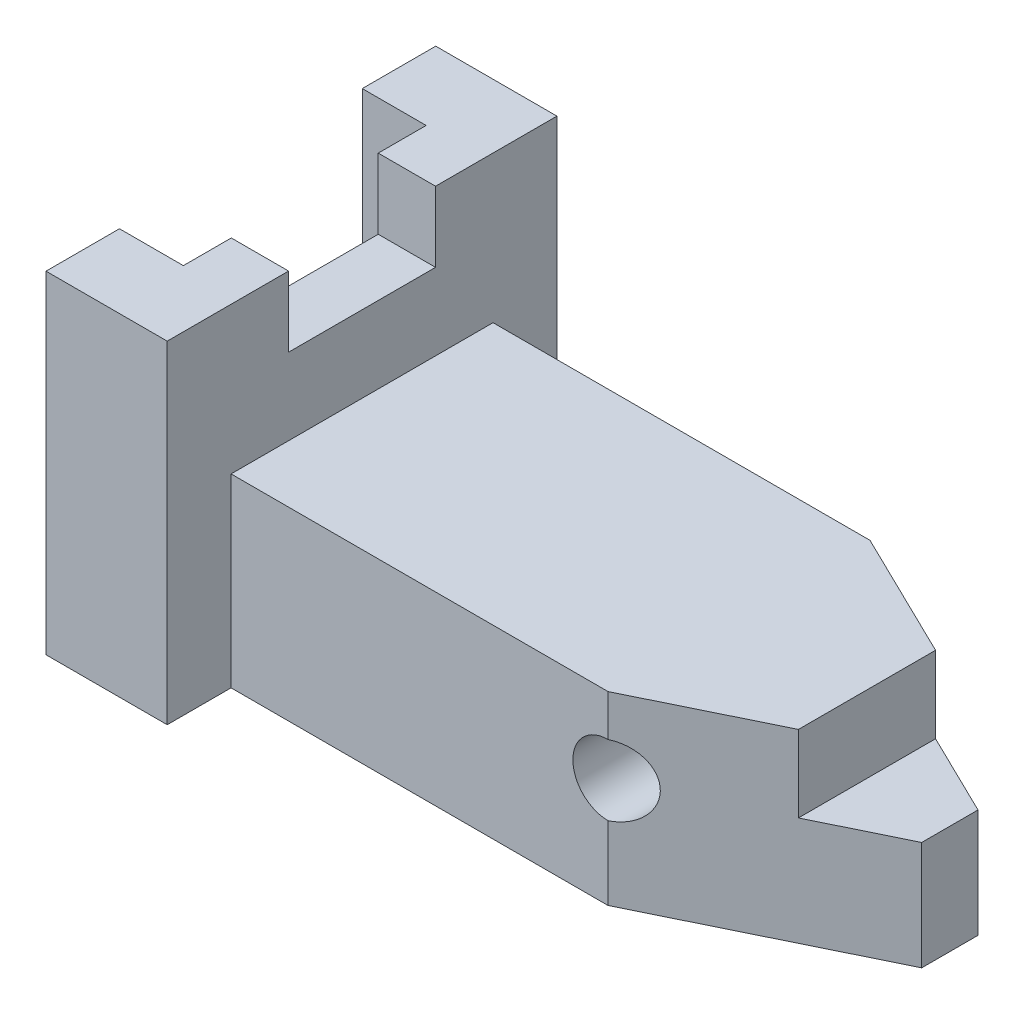
ISO-10303-21;
HEADER;
FILE_DESCRIPTION(('STEP AP214'),'2;1');
FILE_NAME('part.step','',(''),(''),'','','');
FILE_SCHEMA(('AUTOMOTIVE_DESIGN { 1 0 10303 214 1 1 1 1 }'));
ENDSEC;
DATA;
#1=APPLICATION_CONTEXT('core data for automotive mechanical design processes');
#2=APPLICATION_PROTOCOL_DEFINITION('international standard','automotive_design',2000,#1);
#3=PRODUCT_CONTEXT('',#1,'mechanical');
#4=PRODUCT('Part','Part','',(#3));
#5=PRODUCT_RELATED_PRODUCT_CATEGORY('part','',(#4));
#6=PRODUCT_DEFINITION_FORMATION('','',#4);
#7=PRODUCT_DEFINITION_CONTEXT('part definition',#1,'design');
#8=PRODUCT_DEFINITION('design','',#6,#7);
#9=PRODUCT_DEFINITION_SHAPE('','',#8);
#10=(LENGTH_UNIT() NAMED_UNIT(*) SI_UNIT(.MILLI.,.METRE.));
#11=(NAMED_UNIT(*) PLANE_ANGLE_UNIT() SI_UNIT($,.RADIAN.));
#12=(NAMED_UNIT(*) SI_UNIT($,.STERADIAN.) SOLID_ANGLE_UNIT());
#13=UNCERTAINTY_MEASURE_WITH_UNIT(LENGTH_MEASURE(1.E-05),#10,'distance_accuracy_value','');
#14=(GEOMETRIC_REPRESENTATION_CONTEXT(3) GLOBAL_UNCERTAINTY_ASSIGNED_CONTEXT((#13)) GLOBAL_UNIT_ASSIGNED_CONTEXT((#10,
#11,#12)) REPRESENTATION_CONTEXT('',''));
#15=CARTESIAN_POINT('',(0.,0.,0.));
#16=DIRECTION('',(0.,0.,1.));
#17=DIRECTION('',(1.,0.,0.));
#18=AXIS2_PLACEMENT_3D('',#15,#16,#17);
#19=CARTESIAN_POINT('',(0.,52.,0.));
#20=DIRECTION('',(0.,-1.,0.));
#21=DIRECTION('',(0.,0.,-1.));
#22=AXIS2_PLACEMENT_3D('',#19,#20,#21);
#23=PLANE('',#22);
#24=DIRECTION('',(0.,0.,1.));
#25=VECTOR('',#24,1.);
#26=CARTESIAN_POINT('',(18.9687712476238,52.,20.5));
#27=LINE('',#26,#25);
#28=CARTESIAN_POINT('',(18.9687712476238,52.,11.5));
#29=VERTEX_POINT('',#28);
#30=CARTESIAN_POINT('',(18.9687712476211,52.,30.4999999999995));
#31=VERTEX_POINT('',#30);
#32=EDGE_CURVE('E244',#29,#31,#27,.T.);
#33=ORIENTED_EDGE('',*,*,#32,.F.);
#34=DIRECTION('',(1.,0.,0.));
#35=VECTOR('',#34,1.);
#36=CARTESIAN_POINT('',(9.15236408382414,52.,11.5));
#37=LINE('',#36,#35);
#38=CARTESIAN_POINT('',(10.,52.,11.5));
#39=VERTEX_POINT('',#38);
#40=EDGE_CURVE('E237',#39,#29,#37,.T.);
#41=ORIENTED_EDGE('',*,*,#40,.F.);
#42=DIRECTION('',(0.,0.,-1.));
#43=VECTOR('',#42,1.);
#44=CARTESIAN_POINT('',(10.,52.,19.));
#45=LINE('',#44,#43);
#46=CARTESIAN_POINT('',(10.,52.,19.));
#47=VERTEX_POINT('',#46);
#48=EDGE_CURVE('E231',#47,#39,#45,.T.);
#49=ORIENTED_EDGE('',*,*,#48,.F.);
#50=DIRECTION('',(1.,0.,0.));
#51=VECTOR('',#50,1.);
#52=CARTESIAN_POINT('',(-10.,52.,19.));
#53=LINE('',#52,#51);
#54=CARTESIAN_POINT('',(0.,52.,19.));
#55=VERTEX_POINT('',#54);
#56=EDGE_CURVE('E261',#55,#47,#53,.T.);
#57=ORIENTED_EDGE('',*,*,#56,.F.);
#58=DIRECTION('',(0.,0.,1.));
#59=VECTOR('',#58,1.);
#60=CARTESIAN_POINT('',(1.18754821319059E-13,52.,-30.5));
#61=LINE('',#60,#59);
#62=CARTESIAN_POINT('',(-1.32076102518288E-13,52.,30.5));
#63=VERTEX_POINT('',#62);
#64=EDGE_CURVE('E319',#55,#63,#61,.T.);
#65=ORIENTED_EDGE('',*,*,#64,.T.);
#66=DIRECTION('',(1.,0.,0.));
#67=VECTOR('',#66,1.);
#68=CARTESIAN_POINT('',(-1.32076102518288E-13,52.,30.5));
#69=LINE('',#68,#67);
#70=EDGE_CURVE('E324',#63,#31,#69,.T.);
#71=ORIENTED_EDGE('',*,*,#70,.T.);
#72=EDGE_LOOP('',(#33,#41,#49,#57,#65,#71));
#73=FACE_BOUND('',#72,.T.);
#74=ADVANCED_FACE('F41',(#73),#23,.F.);
#75=CARTESIAN_POINT('',(1.18754821319059E-13,52.,-30.5));
#76=DIRECTION('',(1.,0.,0.));
#77=DIRECTION('',(0.,0.,-1.));
#78=AXIS2_PLACEMENT_3D('',#75,#76,#77);
#79=PLANE('',#78);
#80=ORIENTED_EDGE('',*,*,#64,.F.);
#81=DIRECTION('',(0.,-1.,0.));
#82=VECTOR('',#81,1.);
#83=CARTESIAN_POINT('',(0.,52.,19.));
#84=LINE('',#83,#82);
#85=CARTESIAN_POINT('',(-1.32076100459909E-13,0.,19.));
#86=VERTEX_POINT('',#85);
#87=EDGE_CURVE('E272',#55,#86,#84,.T.);
#88=ORIENTED_EDGE('',*,*,#87,.T.);
#89=DIRECTION('',(0.,0.,1.));
#90=VECTOR('',#89,1.);
#91=CARTESIAN_POINT('',(1.18754821319059E-13,0.,-30.5));
#92=LINE('',#91,#90);
#93=CARTESIAN_POINT('',(-1.32076102518288E-13,0.,30.5));
#94=VERTEX_POINT('',#93);
#95=EDGE_CURVE('E341',#86,#94,#92,.T.);
#96=ORIENTED_EDGE('',*,*,#95,.T.);
#97=DIRECTION('',(0.,-1.,0.));
#98=VECTOR('',#97,1.);
#99=CARTESIAN_POINT('',(-1.32076102518288E-13,52.,30.5));
#100=LINE('',#99,#98);
#101=EDGE_CURVE('E326',#63,#94,#100,.T.);
#102=ORIENTED_EDGE('',*,*,#101,.F.);
#103=EDGE_LOOP('',(#80,#88,#96,#102));
#104=FACE_BOUND('',#103,.T.);
#105=ADVANCED_FACE('F387',(#104),#79,.F.);
#106=CARTESIAN_POINT('',(110.968771247624,52.,-4.40482457732681));
#107=DIRECTION('',(-1.,0.,0.));
#108=DIRECTION('',(0.,0.,1.));
#109=AXIS2_PLACEMENT_3D('',#106,#107,#108);
#110=PLANE('',#109);
#111=DIRECTION('',(0.,0.,-1.));
#112=VECTOR('',#111,1.);
#113=CARTESIAN_POINT('',(110.968771247624,17.,-4.40482457732681));
#114=LINE('',#113,#112);
#115=CARTESIAN_POINT('',(110.968771247624,17.,4.40482457732658));
#116=VERTEX_POINT('',#115);
#117=CARTESIAN_POINT('',(110.968771247624,17.,-4.40482457732681));
#118=VERTEX_POINT('',#117);
#119=EDGE_CURVE('E283',#116,#118,#114,.T.);
#120=ORIENTED_EDGE('',*,*,#119,.F.);
#121=DIRECTION('',(0.,-1.,0.));
#122=VECTOR('',#121,1.);
#123=CARTESIAN_POINT('',(110.968771247624,52.,4.40482457732659));
#124=LINE('',#123,#122);
#125=CARTESIAN_POINT('',(110.968771247624,0.,4.40482457732659));
#126=VERTEX_POINT('',#125);
#127=EDGE_CURVE('E210',#116,#126,#124,.T.);
#128=ORIENTED_EDGE('',*,*,#127,.T.);
#129=DIRECTION('',(0.,0.,-1.));
#130=VECTOR('',#129,1.);
#131=CARTESIAN_POINT('',(110.968771247624,0.,-4.40482457732681));
#132=LINE('',#131,#130);
#133=CARTESIAN_POINT('',(110.968771247624,0.,-4.40482457732681));
#134=VERTEX_POINT('',#133);
#135=EDGE_CURVE('E331',#126,#134,#132,.T.);
#136=ORIENTED_EDGE('',*,*,#135,.T.);
#137=DIRECTION('',(0.,-1.,0.));
#138=VECTOR('',#137,1.);
#139=CARTESIAN_POINT('',(110.968771247624,52.,-4.40482457732681));
#140=LINE('',#139,#138);
#141=EDGE_CURVE('E355',#118,#134,#140,.T.);
#142=ORIENTED_EDGE('',*,*,#141,.F.);
#143=EDGE_LOOP('',(#120,#128,#136,#142));
#144=FACE_BOUND('',#143,.T.);
#145=ADVANCED_FACE('F362',(#144),#110,.F.);
#146=CARTESIAN_POINT('',(28.0000000000002,52.,-30.5));
#147=DIRECTION('',(0.,0.,1.));
#148=DIRECTION('',(1.,0.,0.));
#149=AXIS2_PLACEMENT_3D('',#146,#147,#148);
#150=PLANE('',#149);
#151=DIRECTION('',(0.,1.,0.));
#152=VECTOR('',#151,1.);
#153=CARTESIAN_POINT('',(18.9687712476244,52.,-30.5000000000005));
#154=LINE('',#153,#152);
#155=CARTESIAN_POINT('',(18.9687712476244,0.,-30.5000000000005));
#156=VERTEX_POINT('',#155);
#157=CARTESIAN_POINT('',(18.9687712476244,52.,-30.5000000000005));
#158=VERTEX_POINT('',#157);
#159=EDGE_CURVE('E287',#156,#158,#154,.T.);
#160=ORIENTED_EDGE('',*,*,#159,.F.);
#161=DIRECTION('',(-1.,0.,0.));
#162=VECTOR('',#161,1.);
#163=CARTESIAN_POINT('',(28.0000000000002,0.,-30.5));
#164=LINE('',#163,#162);
#165=CARTESIAN_POINT('',(1.18754821319059E-13,0.,-30.5));
#166=VERTEX_POINT('',#165);
#167=EDGE_CURVE('E339',#156,#166,#164,.T.);
#168=ORIENTED_EDGE('',*,*,#167,.T.);
#169=DIRECTION('',(0.,-1.,0.));
#170=VECTOR('',#169,1.);
#171=CARTESIAN_POINT('',(1.18754821319059E-13,52.,-30.5));
#172=LINE('',#171,#170);
#173=CARTESIAN_POINT('',(1.18754821319059E-13,52.,-30.5));
#174=VERTEX_POINT('',#173);
#175=EDGE_CURVE('E349',#174,#166,#172,.T.);
#176=ORIENTED_EDGE('',*,*,#175,.F.);
#177=DIRECTION('',(-1.,0.,0.));
#178=VECTOR('',#177,1.);
#179=CARTESIAN_POINT('',(28.0000000000002,52.,-30.5));
#180=LINE('',#179,#178);
#181=EDGE_CURVE('E317',#158,#174,#180,.T.);
#182=ORIENTED_EDGE('',*,*,#181,.F.);
#183=EDGE_LOOP('',(#160,#168,#176,#182));
#184=FACE_BOUND('',#183,.T.);
#185=ADVANCED_FACE('F399',(#184),#150,.F.);
#186=CARTESIAN_POINT('',(10.,52.,-11.5));
#187=VERTEX_POINT('',#186);
#188=CARTESIAN_POINT('',(10.,52.,-19.));
#189=VERTEX_POINT('',#188);
#190=EDGE_CURVE('E255',#187,#189,#45,.T.);
#191=ORIENTED_EDGE('',*,*,#190,.F.);
#192=DIRECTION('',(-1.,0.,0.));
#193=VECTOR('',#192,1.);
#194=CARTESIAN_POINT('',(9.15236408382414,52.,-11.5));
#195=LINE('',#194,#193);
#196=CARTESIAN_POINT('',(18.9687712476238,52.,-11.5));
#197=VERTEX_POINT('',#196);
#198=EDGE_CURVE('E191',#197,#187,#195,.T.);
#199=ORIENTED_EDGE('',*,*,#198,.F.);
#200=EDGE_CURVE('E305',#158,#197,#27,.T.);
#201=ORIENTED_EDGE('',*,*,#200,.F.);
#202=ORIENTED_EDGE('',*,*,#181,.T.);
#203=CARTESIAN_POINT('',(0.,52.,-19.));
#204=VERTEX_POINT('',#203);
#205=EDGE_CURVE('E321',#174,#204,#61,.T.);
#206=ORIENTED_EDGE('',*,*,#205,.T.);
#207=DIRECTION('',(-1.,0.,0.));
#208=VECTOR('',#207,1.);
#209=CARTESIAN_POINT('',(-10.,52.,-19.));
#210=LINE('',#209,#208);
#211=EDGE_CURVE('E259',#189,#204,#210,.T.);
#212=ORIENTED_EDGE('',*,*,#211,.F.);
#213=EDGE_LOOP('',(#191,#199,#201,#202,#206,#212));
#214=FACE_BOUND('',#213,.T.);
#215=ADVANCED_FACE('F389',(#214),#23,.F.);
#216=CARTESIAN_POINT('',(28.0000000000001,52.,20.5));
#217=DIRECTION('',(0.,0.,-1.));
#218=DIRECTION('',(-1.,0.,0.));
#219=AXIS2_PLACEMENT_3D('',#216,#217,#218);
#220=PLANE('',#219);
#221=DIRECTION('',(0.,-1.,0.));
#222=VECTOR('',#221,1.);
#223=CARTESIAN_POINT('',(77.9687712476239,52.,20.5));
#224=LINE('',#223,#222);
#225=CARTESIAN_POINT('',(77.9687712476239,11.5,20.5));
#226=VERTEX_POINT('',#225);
#227=CARTESIAN_POINT('',(77.9687712476239,0.,20.5));
#228=VERTEX_POINT('',#227);
#229=EDGE_CURVE('E198',#226,#228,#224,.T.);
#230=ORIENTED_EDGE('',*,*,#229,.F.);
#231=CARTESIAN_POINT('',(77.9687712476239,17.,20.5));
#232=DIRECTION('',(0.,0.,1.));
#233=DIRECTION('',(1.,0.,0.));
#234=AXIS2_PLACEMENT_3D('',#231,#232,#233);
#235=CIRCLE('',#234,5.5);
#236=CARTESIAN_POINT('',(77.9687712476239,22.5,20.5));
#237=VERTEX_POINT('',#236);
#238=EDGE_CURVE('E55',#237,#226,#235,.T.);
#239=ORIENTED_EDGE('',*,*,#238,.F.);
#240=CARTESIAN_POINT('',(77.9687712476239,29.,20.5));
#241=VERTEX_POINT('',#240);
#242=EDGE_CURVE('E196',#241,#237,#224,.T.);
#243=ORIENTED_EDGE('',*,*,#242,.F.);
#244=DIRECTION('',(1.,0.,0.));
#245=VECTOR('',#244,1.);
#246=CARTESIAN_POINT('',(18.9687712476238,29.,20.5));
#247=LINE('',#246,#245);
#248=CARTESIAN_POINT('',(18.9687712476238,29.,20.5));
#249=VERTEX_POINT('',#248);
#250=EDGE_CURVE('E308',#249,#241,#247,.T.);
#251=ORIENTED_EDGE('',*,*,#250,.F.);
#252=DIRECTION('',(0.,1.,0.));
#253=VECTOR('',#252,1.);
#254=CARTESIAN_POINT('',(18.9687712476216,0.,20.4999999999995));
#255=LINE('',#254,#253);
#256=CARTESIAN_POINT('',(18.9687712476216,0.,20.4999999999995));
#257=VERTEX_POINT('',#256);
#258=EDGE_CURVE('E294',#257,#249,#255,.T.);
#259=ORIENTED_EDGE('',*,*,#258,.F.);
#260=DIRECTION('',(1.,0.,0.));
#261=VECTOR('',#260,1.);
#262=CARTESIAN_POINT('',(28.0000000000001,0.,20.5));
#263=LINE('',#262,#261);
#264=EDGE_CURVE('E316',#257,#228,#263,.T.);
#265=ORIENTED_EDGE('',*,*,#264,.T.);
#266=EDGE_LOOP('',(#230,#239,#243,#251,#259,#265));
#267=FACE_BOUND('',#266,.T.);
#268=ADVANCED_FACE('F43',(#267),#220,.F.);
#269=CARTESIAN_POINT('',(77.9687712476239,52.,20.5));
#270=DIRECTION('',(-0.438371146789078,0.,-0.898794046299167));
#271=DIRECTION('',(-0.898794046299167,0.,0.438371146789078));
#272=AXIS2_PLACEMENT_3D('',#269,#270,#271);
#273=PLANE('',#272);
#274=ORIENTED_EDGE('',*,*,#242,.T.);
#275=CARTESIAN_POINT('',(77.9687712476239,17.,20.5));
#276=DIRECTION('',(-0.438371146789078,0.,-0.898794046299167));
#277=DIRECTION('',(-0.898794046299167,0.,0.438371146789078));
#278=AXIS2_PLACEMENT_3D('',#275,#276,#277);
#279=ELLIPSE('',#278,6.11931067261354,5.5);
#280=EDGE_CURVE('E186',#237,#226,#279,.T.);
#281=ORIENTED_EDGE('',*,*,#280,.T.);
#282=ORIENTED_EDGE('',*,*,#229,.T.);
#283=DIRECTION('',(0.898794046299167,0.,-0.438371146789078));
#284=VECTOR('',#283,1.);
#285=CARTESIAN_POINT('',(77.9687712476239,0.,20.5));
#286=LINE('',#285,#284);
#287=EDGE_CURVE('E328',#228,#126,#286,.T.);
#288=ORIENTED_EDGE('',*,*,#287,.T.);
#289=ORIENTED_EDGE('',*,*,#127,.F.);
#290=DIRECTION('',(0.898794046299167,0.,-0.438371146789078));
#291=VECTOR('',#290,1.);
#292=CARTESIAN_POINT('',(77.9687712476239,17.,20.5));
#293=LINE('',#292,#291);
#294=CARTESIAN_POINT('',(98.0000000000001,17.,10.7301169484486));
#295=VERTEX_POINT('',#294);
#296=EDGE_CURVE('E285',#295,#116,#293,.T.);
#297=ORIENTED_EDGE('',*,*,#296,.F.);
#298=DIRECTION('',(0.,1.,0.));
#299=VECTOR('',#298,1.);
#300=CARTESIAN_POINT('',(98.0000000000001,52.,10.7301169484486));
#301=LINE('',#300,#299);
#302=CARTESIAN_POINT('',(98.0000000000001,29.,10.7301169484486));
#303=VERTEX_POINT('',#302);
#304=EDGE_CURVE('E281',#295,#303,#301,.T.);
#305=ORIENTED_EDGE('',*,*,#304,.T.);
#306=DIRECTION('',(-0.898794046299167,0.,0.438371146789078));
#307=VECTOR('',#306,1.);
#308=CARTESIAN_POINT('',(77.9687712476239,29.,20.5));
#309=LINE('',#308,#307);
#310=EDGE_CURVE('E203',#303,#241,#309,.T.);
#311=ORIENTED_EDGE('',*,*,#310,.T.);
#312=EDGE_LOOP('',(#274,#281,#282,#288,#289,#297,#305,#311));
#313=FACE_BOUND('',#312,.T.);
#314=ADVANCED_FACE('F200',(#313),#273,.F.);
#315=CARTESIAN_POINT('',(110.968771247624,52.,-4.40482457732681));
#316=DIRECTION('',(-0.438371146789072,0.,0.898794046299169));
#317=DIRECTION('',(0.89879404629917,0.,0.438371146789072));
#318=AXIS2_PLACEMENT_3D('',#315,#316,#317);
#319=PLANE('',#318);
#320=DIRECTION('',(0.,-1.,0.));
#321=VECTOR('',#320,1.);
#322=CARTESIAN_POINT('',(77.9687712476238,52.,-20.5));
#323=LINE('',#322,#321);
#324=CARTESIAN_POINT('',(77.9687712476238,11.5,-20.5));
#325=VERTEX_POINT('',#324);
#326=CARTESIAN_POINT('',(77.9687712476238,0.,-20.5));
#327=VERTEX_POINT('',#326);
#328=EDGE_CURVE('E352',#325,#327,#323,.T.);
#329=ORIENTED_EDGE('',*,*,#328,.F.);
#330=CARTESIAN_POINT('',(77.9687712476239,17.,-20.4999999999999));
#331=DIRECTION('',(-0.438371146789072,0.,0.898794046299169));
#332=DIRECTION('',(0.89879404629917,0.,0.438371146789072));
#333=AXIS2_PLACEMENT_3D('',#330,#331,#332);
#334=ELLIPSE('',#333,6.11931067261353,5.5);
#335=CARTESIAN_POINT('',(77.9687712476238,22.5,-20.5));
#336=VERTEX_POINT('',#335);
#337=EDGE_CURVE('E62',#325,#336,#334,.T.);
#338=ORIENTED_EDGE('',*,*,#337,.T.);
#339=CARTESIAN_POINT('',(77.9687712476238,29.,-20.5));
#340=VERTEX_POINT('',#339);
#341=EDGE_CURVE('E353',#340,#336,#323,.T.);
#342=ORIENTED_EDGE('',*,*,#341,.F.);
#343=DIRECTION('',(0.89879404629917,0.,0.438371146789072));
#344=VECTOR('',#343,1.);
#345=CARTESIAN_POINT('',(110.968771247624,29.,-4.40482457732681));
#346=LINE('',#345,#344);
#347=CARTESIAN_POINT('',(98.0000000000001,29.,-10.7301169484487));
#348=VERTEX_POINT('',#347);
#349=EDGE_CURVE('E311',#340,#348,#346,.T.);
#350=ORIENTED_EDGE('',*,*,#349,.T.);
#351=DIRECTION('',(0.,-1.,0.));
#352=VECTOR('',#351,1.);
#353=CARTESIAN_POINT('',(98.0000000000001,52.,-10.7301169484487));
#354=LINE('',#353,#352);
#355=CARTESIAN_POINT('',(98.0000000000001,17.,-10.7301169484488));
#356=VERTEX_POINT('',#355);
#357=EDGE_CURVE('E278',#348,#356,#354,.T.);
#358=ORIENTED_EDGE('',*,*,#357,.T.);
#359=DIRECTION('',(-0.89879404629917,0.,-0.438371146789072));
#360=VECTOR('',#359,1.);
#361=CARTESIAN_POINT('',(110.968771247624,17.,-4.40482457732681));
#362=LINE('',#361,#360);
#363=EDGE_CURVE('E208',#118,#356,#362,.T.);
#364=ORIENTED_EDGE('',*,*,#363,.F.);
#365=ORIENTED_EDGE('',*,*,#141,.T.);
#366=DIRECTION('',(-0.89879404629917,0.,-0.438371146789072));
#367=VECTOR('',#366,1.);
#368=CARTESIAN_POINT('',(110.968771247624,0.,-4.40482457732681));
#369=LINE('',#368,#367);
#370=EDGE_CURVE('E334',#134,#327,#369,.T.);
#371=ORIENTED_EDGE('',*,*,#370,.T.);
#372=EDGE_LOOP('',(#329,#338,#342,#350,#358,#364,#365,#371));
#373=FACE_BOUND('',#372,.T.);
#374=ADVANCED_FACE('F373',(#373),#319,.F.);
#375=CARTESIAN_POINT('',(77.9687712476238,52.,-20.5));
#376=DIRECTION('',(0.,0.,1.));
#377=DIRECTION('',(1.,0.,0.));
#378=AXIS2_PLACEMENT_3D('',#375,#376,#377);
#379=PLANE('',#378);
#380=ORIENTED_EDGE('',*,*,#341,.T.);
#381=CARTESIAN_POINT('',(77.9687712476239,17.,-20.5));
#382=DIRECTION('',(0.,0.,1.));
#383=DIRECTION('',(1.,0.,0.));
#384=AXIS2_PLACEMENT_3D('',#381,#382,#383);
#385=CIRCLE('',#384,5.5);
#386=EDGE_CURVE('E11',#336,#325,#385,.T.);
#387=ORIENTED_EDGE('',*,*,#386,.T.);
#388=ORIENTED_EDGE('',*,*,#328,.T.);
#389=DIRECTION('',(-1.,0.,0.));
#390=VECTOR('',#389,1.);
#391=CARTESIAN_POINT('',(77.9687712476238,0.,-20.5));
#392=LINE('',#391,#390);
#393=CARTESIAN_POINT('',(18.9687712476238,0.,-20.5000000000005));
#394=VERTEX_POINT('',#393);
#395=EDGE_CURVE('E337',#327,#394,#392,.T.);
#396=ORIENTED_EDGE('',*,*,#395,.T.);
#397=DIRECTION('',(0.,-1.,0.));
#398=VECTOR('',#397,1.);
#399=CARTESIAN_POINT('',(18.9687712476238,52.,-20.5000000000005));
#400=LINE('',#399,#398);
#401=CARTESIAN_POINT('',(18.9687712476238,29.,-20.5000000000005));
#402=VERTEX_POINT('',#401);
#403=EDGE_CURVE('E291',#402,#394,#400,.T.);
#404=ORIENTED_EDGE('',*,*,#403,.F.);
#405=DIRECTION('',(1.,0.,0.));
#406=VECTOR('',#405,1.);
#407=CARTESIAN_POINT('',(18.9687712476238,29.,-20.5));
#408=LINE('',#407,#406);
#409=EDGE_CURVE('E309',#402,#340,#408,.T.);
#410=ORIENTED_EDGE('',*,*,#409,.T.);
#411=EDGE_LOOP('',(#380,#387,#388,#396,#404,#410));
#412=FACE_BOUND('',#411,.T.);
#413=ADVANCED_FACE('F376',(#412),#379,.F.);
#414=CARTESIAN_POINT('',(0.,0.,-19.));
#415=VERTEX_POINT('',#414);
#416=EDGE_CURVE('E342',#166,#415,#92,.T.);
#417=ORIENTED_EDGE('',*,*,#416,.T.);
#418=DIRECTION('',(0.,1.,0.));
#419=VECTOR('',#418,1.);
#420=CARTESIAN_POINT('',(0.,52.,-19.));
#421=LINE('',#420,#419);
#422=EDGE_CURVE('E267',#415,#204,#421,.T.);
#423=ORIENTED_EDGE('',*,*,#422,.T.);
#424=ORIENTED_EDGE('',*,*,#205,.F.);
#425=ORIENTED_EDGE('',*,*,#175,.T.);
#426=EDGE_LOOP('',(#417,#423,#424,#425));
#427=FACE_BOUND('',#426,.T.);
#428=ADVANCED_FACE('F395',(#427),#79,.F.);
#429=CARTESIAN_POINT('',(-1.32076102518288E-13,52.,30.5));
#430=DIRECTION('',(0.,0.,-1.));
#431=DIRECTION('',(-1.,0.,0.));
#432=AXIS2_PLACEMENT_3D('',#429,#430,#431);
#433=PLANE('',#432);
#434=DIRECTION('',(1.,0.,0.));
#435=VECTOR('',#434,1.);
#436=CARTESIAN_POINT('',(-1.32076102518288E-13,0.,30.5));
#437=LINE('',#436,#435);
#438=CARTESIAN_POINT('',(18.9687712476211,0.,30.4999999999995));
#439=VERTEX_POINT('',#438);
#440=EDGE_CURVE('E320',#94,#439,#437,.T.);
#441=ORIENTED_EDGE('',*,*,#440,.T.);
#442=DIRECTION('',(0.,-1.,0.));
#443=VECTOR('',#442,1.);
#444=CARTESIAN_POINT('',(18.9687712476211,0.,30.4999999999995));
#445=LINE('',#444,#443);
#446=EDGE_CURVE('E288',#31,#439,#445,.T.);
#447=ORIENTED_EDGE('',*,*,#446,.F.);
#448=ORIENTED_EDGE('',*,*,#70,.F.);
#449=ORIENTED_EDGE('',*,*,#101,.T.);
#450=EDGE_LOOP('',(#441,#447,#448,#449));
#451=FACE_BOUND('',#450,.T.);
#452=ADVANCED_FACE('F442',(#451),#433,.F.);
#453=CARTESIAN_POINT('',(0.,0.,0.));
#454=DIRECTION('',(0.,-1.,0.));
#455=DIRECTION('',(0.,0.,-1.));
#456=AXIS2_PLACEMENT_3D('',#453,#454,#455);
#457=PLANE('',#456);
#458=DIRECTION('',(-1.,0.,0.));
#459=VECTOR('',#458,1.);
#460=CARTESIAN_POINT('',(0.,0.,19.));
#461=LINE('',#460,#459);
#462=CARTESIAN_POINT('',(10.,0.,19.));
#463=VERTEX_POINT('',#462);
#464=EDGE_CURVE('E219',#463,#86,#461,.T.);
#465=ORIENTED_EDGE('',*,*,#464,.F.);
#466=DIRECTION('',(0.,0.,1.));
#467=VECTOR('',#466,1.);
#468=CARTESIAN_POINT('',(10.,0.,0.));
#469=LINE('',#468,#467);
#470=CARTESIAN_POINT('',(10.,0.,-19.));
#471=VERTEX_POINT('',#470);
#472=EDGE_CURVE('E217',#471,#463,#469,.T.);
#473=ORIENTED_EDGE('',*,*,#472,.F.);
#474=DIRECTION('',(1.,0.,0.));
#475=VECTOR('',#474,1.);
#476=CARTESIAN_POINT('',(0.,0.,-19.));
#477=LINE('',#476,#475);
#478=EDGE_CURVE('E215',#415,#471,#477,.T.);
#479=ORIENTED_EDGE('',*,*,#478,.F.);
#480=ORIENTED_EDGE('',*,*,#416,.F.);
#481=ORIENTED_EDGE('',*,*,#167,.F.);
#482=DIRECTION('',(0.,0.,-1.));
#483=VECTOR('',#482,1.);
#484=CARTESIAN_POINT('',(18.9687712476238,0.,-20.5000000000005));
#485=LINE('',#484,#483);
#486=EDGE_CURVE('E299',#394,#156,#485,.T.);
#487=ORIENTED_EDGE('',*,*,#486,.F.);
#488=ORIENTED_EDGE('',*,*,#395,.F.);
#489=ORIENTED_EDGE('',*,*,#370,.F.);
#490=ORIENTED_EDGE('',*,*,#135,.F.);
#491=ORIENTED_EDGE('',*,*,#287,.F.);
#492=ORIENTED_EDGE('',*,*,#264,.F.);
#493=DIRECTION('',(0.,0.,-1.));
#494=VECTOR('',#493,1.);
#495=CARTESIAN_POINT('',(18.9687712476211,0.,30.4999999999995));
#496=LINE('',#495,#494);
#497=EDGE_CURVE('E290',#439,#257,#496,.T.);
#498=ORIENTED_EDGE('',*,*,#497,.F.);
#499=ORIENTED_EDGE('',*,*,#440,.F.);
#500=ORIENTED_EDGE('',*,*,#95,.F.);
#501=EDGE_LOOP('',(#465,#473,#479,#480,#481,#487,#488,#489,#490,#491,#492,#498,#499,#500));
#502=FACE_BOUND('',#501,.T.);
#503=ADVANCED_FACE('F369',(#502),#457,.T.);
#504=CARTESIAN_POINT('',(18.9687712476238,29.,20.5));
#505=DIRECTION('',(0.,-1.,0.));
#506=DIRECTION('',(0.,0.,-1.));
#507=AXIS2_PLACEMENT_3D('',#504,#505,#506);
#508=PLANE('',#507);
#509=ORIENTED_EDGE('',*,*,#310,.F.);
#510=DIRECTION('',(0.,0.,-1.));
#511=VECTOR('',#510,1.);
#512=CARTESIAN_POINT('',(98.0000000000001,29.,20.5));
#513=LINE('',#512,#511);
#514=EDGE_CURVE('E205',#303,#348,#513,.T.);
#515=ORIENTED_EDGE('',*,*,#514,.T.);
#516=ORIENTED_EDGE('',*,*,#349,.F.);
#517=ORIENTED_EDGE('',*,*,#409,.F.);
#518=DIRECTION('',(0.,0.,-1.));
#519=VECTOR('',#518,1.);
#520=CARTESIAN_POINT('',(18.9687712476238,29.,20.5));
#521=LINE('',#520,#519);
#522=EDGE_CURVE('E296',#249,#402,#521,.T.);
#523=ORIENTED_EDGE('',*,*,#522,.F.);
#524=ORIENTED_EDGE('',*,*,#250,.T.);
#525=EDGE_LOOP('',(#509,#515,#516,#517,#523,#524));
#526=FACE_BOUND('',#525,.T.);
#527=ADVANCED_FACE('F430',(#526),#508,.F.);
#528=CARTESIAN_POINT('',(18.9687712476238,0.,0.));
#529=DIRECTION('',(-1.,0.,0.));
#530=DIRECTION('',(0.,0.,1.));
#531=AXIS2_PLACEMENT_3D('',#528,#529,#530);
#532=PLANE('',#531);
#533=DIRECTION('',(0.,0.,-1.));
#534=VECTOR('',#533,1.);
#535=CARTESIAN_POINT('',(18.9687712476238,41.,11.5));
#536=LINE('',#535,#534);
#537=CARTESIAN_POINT('',(18.9687712476238,41.,11.5));
#538=VERTEX_POINT('',#537);
#539=CARTESIAN_POINT('',(18.9687712476238,41.,-11.5));
#540=VERTEX_POINT('',#539);
#541=EDGE_CURVE('E245',#538,#540,#536,.T.);
#542=ORIENTED_EDGE('',*,*,#541,.F.);
#543=DIRECTION('',(0.,1.,0.));
#544=VECTOR('',#543,1.);
#545=CARTESIAN_POINT('',(18.9687712476238,41.,11.5));
#546=LINE('',#545,#544);
#547=EDGE_CURVE('E253',#538,#29,#546,.T.);
#548=ORIENTED_EDGE('',*,*,#547,.T.);
#549=ORIENTED_EDGE('',*,*,#32,.T.);
#550=ORIENTED_EDGE('',*,*,#446,.T.);
#551=ORIENTED_EDGE('',*,*,#497,.T.);
#552=ORIENTED_EDGE('',*,*,#258,.T.);
#553=ORIENTED_EDGE('',*,*,#522,.T.);
#554=ORIENTED_EDGE('',*,*,#403,.T.);
#555=ORIENTED_EDGE('',*,*,#486,.T.);
#556=ORIENTED_EDGE('',*,*,#159,.T.);
#557=ORIENTED_EDGE('',*,*,#200,.T.);
#558=DIRECTION('',(0.,1.,0.));
#559=VECTOR('',#558,1.);
#560=CARTESIAN_POINT('',(18.9687712476238,41.,-11.5));
#561=LINE('',#560,#559);
#562=EDGE_CURVE('E256',#540,#197,#561,.T.);
#563=ORIENTED_EDGE('',*,*,#562,.F.);
#564=EDGE_LOOP('',(#542,#548,#549,#550,#551,#552,#553,#554,#555,#556,#557,#563));
#565=FACE_BOUND('',#564,.T.);
#566=ADVANCED_FACE('F425',(#565),#532,.F.);
#567=CARTESIAN_POINT('',(0.,17.,0.));
#568=DIRECTION('',(0.,1.,0.));
#569=DIRECTION('',(0.,0.,1.));
#570=AXIS2_PLACEMENT_3D('',#567,#568,#569);
#571=PLANE('',#570);
#572=ORIENTED_EDGE('',*,*,#296,.T.);
#573=ORIENTED_EDGE('',*,*,#119,.T.);
#574=ORIENTED_EDGE('',*,*,#363,.T.);
#575=DIRECTION('',(0.,0.,1.));
#576=VECTOR('',#575,1.);
#577=CARTESIAN_POINT('',(98.0000000000001,17.,-12.4043173215365));
#578=LINE('',#577,#576);
#579=EDGE_CURVE('E275',#356,#295,#578,.T.);
#580=ORIENTED_EDGE('',*,*,#579,.T.);
#581=EDGE_LOOP('',(#572,#573,#574,#580));
#582=FACE_BOUND('',#581,.T.);
#583=ADVANCED_FACE('F435',(#582),#571,.T.);
#584=CARTESIAN_POINT('',(98.0000000000001,17.,-12.4043173215365));
#585=DIRECTION('',(-1.,0.,0.));
#586=DIRECTION('',(0.,0.,1.));
#587=AXIS2_PLACEMENT_3D('',#584,#585,#586);
#588=PLANE('',#587);
#589=ORIENTED_EDGE('',*,*,#579,.F.);
#590=ORIENTED_EDGE('',*,*,#357,.F.);
#591=ORIENTED_EDGE('',*,*,#514,.F.);
#592=ORIENTED_EDGE('',*,*,#304,.F.);
#593=EDGE_LOOP('',(#589,#590,#591,#592));
#594=FACE_BOUND('',#593,.T.);
#595=ADVANCED_FACE('F433',(#594),#588,.F.);
#596=CARTESIAN_POINT('',(-10.,-10.,19.));
#597=DIRECTION('',(0.,0.,1.));
#598=DIRECTION('',(1.,0.,0.));
#599=AXIS2_PLACEMENT_3D('',#596,#597,#598);
#600=PLANE('',#599);
#601=ORIENTED_EDGE('',*,*,#56,.T.);
#602=DIRECTION('',(0.,1.,0.));
#603=VECTOR('',#602,1.);
#604=CARTESIAN_POINT('',(10.,-10.,19.));
#605=LINE('',#604,#603);
#606=EDGE_CURVE('E265',#463,#47,#605,.T.);
#607=ORIENTED_EDGE('',*,*,#606,.F.);
#608=ORIENTED_EDGE('',*,*,#464,.T.);
#609=ORIENTED_EDGE('',*,*,#87,.F.);
#610=EDGE_LOOP('',(#601,#607,#608,#609));
#611=FACE_BOUND('',#610,.T.);
#612=ADVANCED_FACE('F448',(#611),#600,.F.);
#613=CARTESIAN_POINT('',(-10.,-10.,-19.));
#614=DIRECTION('',(0.,0.,-1.));
#615=DIRECTION('',(-1.,0.,0.));
#616=AXIS2_PLACEMENT_3D('',#613,#614,#615);
#617=PLANE('',#616);
#618=ORIENTED_EDGE('',*,*,#478,.T.);
#619=DIRECTION('',(0.,1.,0.));
#620=VECTOR('',#619,1.);
#621=CARTESIAN_POINT('',(10.,-10.,-19.));
#622=LINE('',#621,#620);
#623=EDGE_CURVE('E264',#471,#189,#622,.T.);
#624=ORIENTED_EDGE('',*,*,#623,.T.);
#625=ORIENTED_EDGE('',*,*,#211,.T.);
#626=ORIENTED_EDGE('',*,*,#422,.F.);
#627=EDGE_LOOP('',(#618,#624,#625,#626));
#628=FACE_BOUND('',#627,.T.);
#629=ADVANCED_FACE('F414',(#628),#617,.F.);
#630=CARTESIAN_POINT('',(10.,-10.,19.));
#631=DIRECTION('',(1.,0.,0.));
#632=DIRECTION('',(0.,0.,-1.));
#633=AXIS2_PLACEMENT_3D('',#630,#631,#632);
#634=PLANE('',#633);
#635=ORIENTED_EDGE('',*,*,#48,.T.);
#636=DIRECTION('',(0.,-1.,0.));
#637=VECTOR('',#636,1.);
#638=CARTESIAN_POINT('',(10.,-10.,11.5));
#639=LINE('',#638,#637);
#640=CARTESIAN_POINT('',(10.,41.,11.5));
#641=VERTEX_POINT('',#640);
#642=EDGE_CURVE('E49',#39,#641,#639,.T.);
#643=ORIENTED_EDGE('',*,*,#642,.T.);
#644=DIRECTION('',(0.,0.,-1.));
#645=VECTOR('',#644,1.);
#646=CARTESIAN_POINT('',(10.,41.,19.));
#647=LINE('',#646,#645);
#648=CARTESIAN_POINT('',(10.,41.,-11.5));
#649=VERTEX_POINT('',#648);
#650=EDGE_CURVE('E221',#641,#649,#647,.T.);
#651=ORIENTED_EDGE('',*,*,#650,.T.);
#652=DIRECTION('',(0.,1.,0.));
#653=VECTOR('',#652,1.);
#654=CARTESIAN_POINT('',(10.,-10.,-11.5));
#655=LINE('',#654,#653);
#656=EDGE_CURVE('E224',#649,#187,#655,.T.);
#657=ORIENTED_EDGE('',*,*,#656,.T.);
#658=ORIENTED_EDGE('',*,*,#190,.T.);
#659=ORIENTED_EDGE('',*,*,#623,.F.);
#660=ORIENTED_EDGE('',*,*,#472,.T.);
#661=ORIENTED_EDGE('',*,*,#606,.T.);
#662=EDGE_LOOP('',(#635,#643,#651,#657,#658,#659,#660,#661));
#663=FACE_BOUND('',#662,.T.);
#664=ADVANCED_FACE('F229',(#663),#634,.F.);
#665=CARTESIAN_POINT('',(9.15236408382414,41.,11.5));
#666=DIRECTION('',(0.,0.,1.));
#667=DIRECTION('',(1.,0.,0.));
#668=AXIS2_PLACEMENT_3D('',#665,#666,#667);
#669=PLANE('',#668);
#670=ORIENTED_EDGE('',*,*,#40,.T.);
#671=ORIENTED_EDGE('',*,*,#547,.F.);
#672=DIRECTION('',(1.,0.,0.));
#673=VECTOR('',#672,1.);
#674=CARTESIAN_POINT('',(9.15236408382414,41.,11.5));
#675=LINE('',#674,#673);
#676=EDGE_CURVE('E239',#641,#538,#675,.T.);
#677=ORIENTED_EDGE('',*,*,#676,.F.);
#678=ORIENTED_EDGE('',*,*,#642,.F.);
#679=EDGE_LOOP('',(#670,#671,#677,#678));
#680=FACE_BOUND('',#679,.T.);
#681=ADVANCED_FACE('F235',(#680),#669,.F.);
#682=CARTESIAN_POINT('',(9.15236408382414,41.,-11.5));
#683=DIRECTION('',(0.,0.,-1.));
#684=DIRECTION('',(-1.,0.,0.));
#685=AXIS2_PLACEMENT_3D('',#682,#683,#684);
#686=PLANE('',#685);
#687=DIRECTION('',(-1.,0.,0.));
#688=VECTOR('',#687,1.);
#689=CARTESIAN_POINT('',(9.15236408382414,41.,-11.5));
#690=LINE('',#689,#688);
#691=EDGE_CURVE('E248',#540,#649,#690,.T.);
#692=ORIENTED_EDGE('',*,*,#691,.F.);
#693=ORIENTED_EDGE('',*,*,#562,.T.);
#694=ORIENTED_EDGE('',*,*,#198,.T.);
#695=ORIENTED_EDGE('',*,*,#656,.F.);
#696=EDGE_LOOP('',(#692,#693,#694,#695));
#697=FACE_BOUND('',#696,.T.);
#698=ADVANCED_FACE('F383',(#697),#686,.F.);
#699=CARTESIAN_POINT('',(0.,41.,0.));
#700=DIRECTION('',(0.,-1.,0.));
#701=DIRECTION('',(0.,0.,-1.));
#702=AXIS2_PLACEMENT_3D('',#699,#700,#701);
#703=PLANE('',#702);
#704=ORIENTED_EDGE('',*,*,#676,.T.);
#705=ORIENTED_EDGE('',*,*,#541,.T.);
#706=ORIENTED_EDGE('',*,*,#691,.T.);
#707=ORIENTED_EDGE('',*,*,#650,.F.);
#708=EDGE_LOOP('',(#704,#705,#706,#707));
#709=FACE_BOUND('',#708,.T.);
#710=ADVANCED_FACE('F378',(#709),#703,.F.);
#711=CARTESIAN_POINT('',(77.9687712476239,17.,-30.5000000000005));
#712=DIRECTION('',(0.,0.,1.));
#713=DIRECTION('',(1.,0.,0.));
#714=AXIS2_PLACEMENT_3D('',#711,#712,#713);
#715=CYLINDRICAL_SURFACE('',#714,5.5);
#716=ORIENTED_EDGE('',*,*,#386,.F.);
#717=ORIENTED_EDGE('',*,*,#337,.F.);
#718=EDGE_LOOP('',(#716,#717));
#719=FACE_BOUND('',#718,.T.);
#720=ORIENTED_EDGE('',*,*,#238,.T.);
#721=ORIENTED_EDGE('',*,*,#280,.F.);
#722=EDGE_LOOP('',(#720,#721));
#723=FACE_BOUND('',#722,.T.);
#724=ADVANCED_FACE('F187',(#719,#723),#715,.F.);
#725=CLOSED_SHELL('',(#74,#105,#145,#185,#215,#268,#314,#374,#413,#428,#452,#503,#527,#566,#583,
#595,#612,#629,#664,#681,#698,#710,#724));
#726=MANIFOLD_SOLID_BREP('B2',#725);
#727=ADVANCED_BREP_SHAPE_REPRESENTATION('',(#18,#726),#14);
#728=SHAPE_DEFINITION_REPRESENTATION(#9,#727);
ENDSEC;
END-ISO-10303-21;
